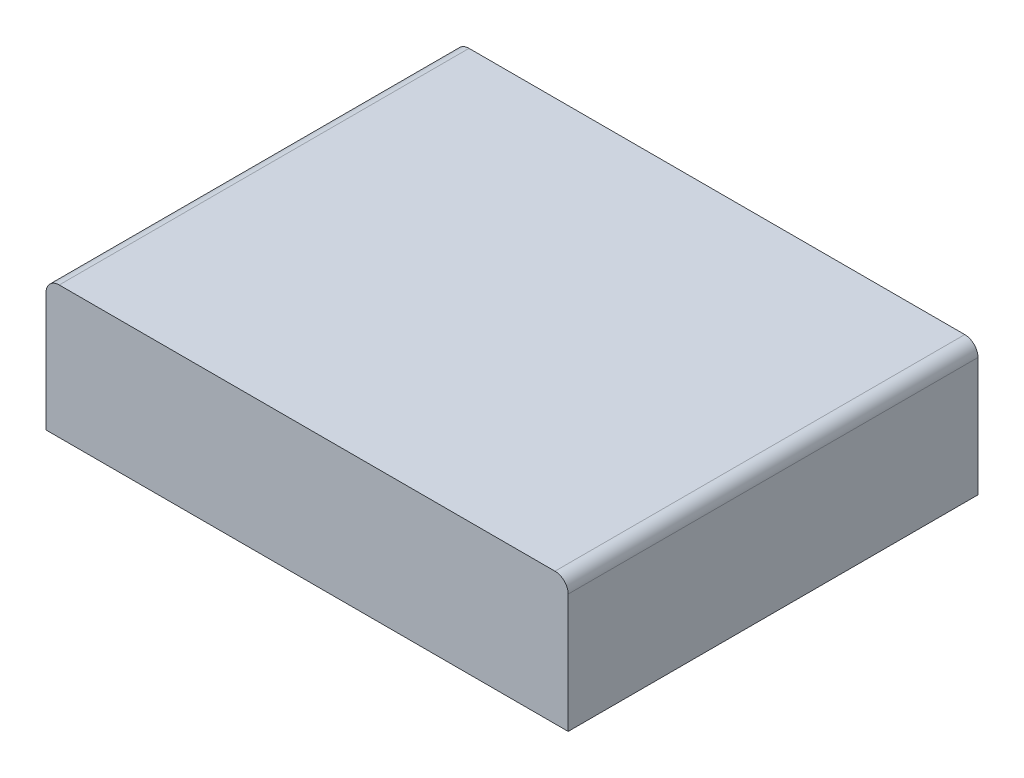
ISO-10303-21;
HEADER;
FILE_DESCRIPTION(('STEP AP214'),'2;1');
FILE_NAME('part.step','',(''),(''),'','','');
FILE_SCHEMA(('AUTOMOTIVE_DESIGN { 1 0 10303 214 1 1 1 1 }'));
ENDSEC;
DATA;
#1=APPLICATION_CONTEXT('core data for automotive mechanical design processes');
#2=APPLICATION_PROTOCOL_DEFINITION('international standard','automotive_design',2000,#1);
#3=PRODUCT_CONTEXT('',#1,'mechanical');
#4=PRODUCT('Part','Part','',(#3));
#5=PRODUCT_RELATED_PRODUCT_CATEGORY('part','',(#4));
#6=PRODUCT_DEFINITION_FORMATION('','',#4);
#7=PRODUCT_DEFINITION_CONTEXT('part definition',#1,'design');
#8=PRODUCT_DEFINITION('design','',#6,#7);
#9=PRODUCT_DEFINITION_SHAPE('','',#8);
#10=(LENGTH_UNIT() NAMED_UNIT(*) SI_UNIT(.MILLI.,.METRE.));
#11=(NAMED_UNIT(*) PLANE_ANGLE_UNIT() SI_UNIT($,.RADIAN.));
#12=(NAMED_UNIT(*) SI_UNIT($,.STERADIAN.) SOLID_ANGLE_UNIT());
#13=UNCERTAINTY_MEASURE_WITH_UNIT(LENGTH_MEASURE(1.E-05),#10,'distance_accuracy_value','');
#14=(GEOMETRIC_REPRESENTATION_CONTEXT(3) GLOBAL_UNCERTAINTY_ASSIGNED_CONTEXT((#13)) GLOBAL_UNIT_ASSIGNED_CONTEXT((#10,
#11,#12)) REPRESENTATION_CONTEXT('',''));
#15=CARTESIAN_POINT('',(0.,0.,0.));
#16=DIRECTION('',(0.,0.,1.));
#17=DIRECTION('',(1.,0.,0.));
#18=AXIS2_PLACEMENT_3D('',#15,#16,#17);
#19=CARTESIAN_POINT('',(11.6013862382831,39.1976983767566,241.577881707232));
#20=DIRECTION('',(0.,0.,1.));
#21=DIRECTION('',(1.,0.,0.));
#22=AXIS2_PLACEMENT_3D('',#19,#20,#21);
#23=CYLINDRICAL_SURFACE('',#22,0.0508);
#24=CARTESIAN_POINT('',(11.6013862382831,39.1976983767566,240.790481707232));
#25=DIRECTION('',(0.,0.,1.));
#26=DIRECTION('',(1.,0.,0.));
#27=AXIS2_PLACEMENT_3D('',#24,#25,#26);
#28=CIRCLE('',#27,0.0508);
#29=CARTESIAN_POINT('',(11.6013862382831,39.2484983767566,240.790481707232));
#30=VERTEX_POINT('',#29);
#31=CARTESIAN_POINT('',(11.5505862382831,39.1976983767566,240.790481707232));
#32=VERTEX_POINT('',#31);
#33=EDGE_CURVE('E126',#30,#32,#28,.T.);
#34=ORIENTED_EDGE('',*,*,#33,.T.);
#35=DIRECTION('',(0.,0.,-1.));
#36=VECTOR('',#35,1.);
#37=CARTESIAN_POINT('',(11.5505862382831,39.1976983767566,242.365281707232));
#38=LINE('',#37,#36);
#39=CARTESIAN_POINT('',(11.5505862382831,39.1976983767566,242.365281707232));
#40=VERTEX_POINT('',#39);
#41=EDGE_CURVE('E108',#32,#40,#38,.F.);
#42=ORIENTED_EDGE('',*,*,#41,.T.);
#43=CARTESIAN_POINT('',(11.6013862382831,39.1976983767566,242.365281707232));
#44=DIRECTION('',(0.,0.,1.));
#45=DIRECTION('',(1.,0.,0.));
#46=AXIS2_PLACEMENT_3D('',#43,#44,#45);
#47=CIRCLE('',#46,0.0508);
#48=CARTESIAN_POINT('',(11.6013862382831,39.2484983767566,242.365281707232));
#49=VERTEX_POINT('',#48);
#50=EDGE_CURVE('E19',#40,#49,#47,.F.);
#51=ORIENTED_EDGE('',*,*,#50,.T.);
#52=DIRECTION('',(0.,0.,-1.));
#53=VECTOR('',#52,1.);
#54=CARTESIAN_POINT('',(11.6013862382831,39.2484983767566,241.577881707232));
#55=LINE('',#54,#53);
#56=EDGE_CURVE('E104',#49,#30,#55,.T.);
#57=ORIENTED_EDGE('',*,*,#56,.T.);
#58=EDGE_LOOP('',(#34,#42,#51,#57));
#59=FACE_BOUND('',#58,.T.);
#60=ADVANCED_FACE('F16',(#59),#23,.T.);
#61=CARTESIAN_POINT('',(13.5063862382831,39.1976983767566,241.577881707232));
#62=DIRECTION('',(0.,0.,-1.));
#63=DIRECTION('',(-1.,0.,0.));
#64=AXIS2_PLACEMENT_3D('',#61,#62,#63);
#65=CYLINDRICAL_SURFACE('',#64,0.0508);
#66=CARTESIAN_POINT('',(13.5063862382831,39.1976983767566,242.365281707232));
#67=DIRECTION('',(0.,0.,-1.));
#68=DIRECTION('',(-1.,0.,0.));
#69=AXIS2_PLACEMENT_3D('',#66,#67,#68);
#70=CIRCLE('',#69,0.0508);
#71=CARTESIAN_POINT('',(13.5063862382831,39.2484983767566,242.365281707232));
#72=VERTEX_POINT('',#71);
#73=CARTESIAN_POINT('',(13.5571862382831,39.1976983767566,242.365281707232));
#74=VERTEX_POINT('',#73);
#75=EDGE_CURVE('E113',#72,#74,#70,.T.);
#76=ORIENTED_EDGE('',*,*,#75,.T.);
#77=DIRECTION('',(0.,0.,1.));
#78=VECTOR('',#77,1.);
#79=CARTESIAN_POINT('',(13.5571862382831,39.1976983767566,242.365281707232));
#80=LINE('',#79,#78);
#81=CARTESIAN_POINT('',(13.5571862382831,39.1976983767566,240.790481707232));
#82=VERTEX_POINT('',#81);
#83=EDGE_CURVE('E100',#74,#82,#80,.F.);
#84=ORIENTED_EDGE('',*,*,#83,.T.);
#85=CARTESIAN_POINT('',(13.5063862382831,39.1976983767566,240.790481707232));
#86=DIRECTION('',(0.,0.,-1.));
#87=DIRECTION('',(-1.,0.,0.));
#88=AXIS2_PLACEMENT_3D('',#85,#86,#87);
#89=CIRCLE('',#88,0.0508);
#90=CARTESIAN_POINT('',(13.5063862382831,39.2484983767566,240.790481707232));
#91=VERTEX_POINT('',#90);
#92=EDGE_CURVE('E122',#82,#91,#89,.F.);
#93=ORIENTED_EDGE('',*,*,#92,.T.);
#94=DIRECTION('',(0.,0.,-1.));
#95=VECTOR('',#94,1.);
#96=CARTESIAN_POINT('',(13.5063862382831,39.2484983767566,241.577881707232));
#97=LINE('',#96,#95);
#98=EDGE_CURVE('E109',#91,#72,#97,.F.);
#99=ORIENTED_EDGE('',*,*,#98,.T.);
#100=EDGE_LOOP('',(#76,#84,#93,#99));
#101=FACE_BOUND('',#100,.T.);
#102=ADVANCED_FACE('F160',(#101),#65,.T.);
#103=CARTESIAN_POINT('',(12.5538862382831,39.2484983767566,241.577881707232));
#104=DIRECTION('',(0.,-1.,0.));
#105=DIRECTION('',(0.,0.,-1.));
#106=AXIS2_PLACEMENT_3D('',#103,#104,#105);
#107=PLANE('',#106);
#108=DIRECTION('',(-1.,0.,0.));
#109=VECTOR('',#108,1.);
#110=CARTESIAN_POINT('',(11.5505862382831,39.2484983767566,242.365281707232));
#111=LINE('',#110,#109);
#112=EDGE_CURVE('E137',#49,#72,#111,.F.);
#113=ORIENTED_EDGE('',*,*,#112,.T.);
#114=ORIENTED_EDGE('',*,*,#98,.F.);
#115=DIRECTION('',(1.,0.,0.));
#116=VECTOR('',#115,1.);
#117=CARTESIAN_POINT('',(11.5505862382831,39.2484983767566,240.790481707232));
#118=LINE('',#117,#116);
#119=EDGE_CURVE('E117',#91,#30,#118,.F.);
#120=ORIENTED_EDGE('',*,*,#119,.T.);
#121=ORIENTED_EDGE('',*,*,#56,.F.);
#122=EDGE_LOOP('',(#113,#114,#120,#121));
#123=FACE_BOUND('',#122,.T.);
#124=ADVANCED_FACE('F135',(#123),#107,.F.);
#125=CARTESIAN_POINT('',(11.5505862382831,39.2484983767566,242.365281707232));
#126=DIRECTION('',(1.,0.,0.));
#127=DIRECTION('',(0.,0.,-1.));
#128=AXIS2_PLACEMENT_3D('',#125,#126,#127);
#129=PLANE('',#128);
#130=DIRECTION('',(0.,1.,0.));
#131=VECTOR('',#130,1.);
#132=CARTESIAN_POINT('',(11.5505862382831,39.2484983767566,240.790481707232));
#133=LINE('',#132,#131);
#134=CARTESIAN_POINT('',(11.5505862382831,38.7404983767566,240.790481707232));
#135=VERTEX_POINT('',#134);
#136=EDGE_CURVE('E78',#32,#135,#133,.F.);
#137=ORIENTED_EDGE('',*,*,#136,.T.);
#138=DIRECTION('',(0.,0.,-1.));
#139=VECTOR('',#138,1.);
#140=CARTESIAN_POINT('',(11.5505862382831,38.7404983767566,241.577881707232));
#141=LINE('',#140,#139);
#142=CARTESIAN_POINT('',(11.5505862382831,38.7404983767566,242.365281707232));
#143=VERTEX_POINT('',#142);
#144=EDGE_CURVE('E73',#143,#135,#141,.T.);
#145=ORIENTED_EDGE('',*,*,#144,.F.);
#146=DIRECTION('',(0.,1.,0.));
#147=VECTOR('',#146,1.);
#148=CARTESIAN_POINT('',(11.5505862382831,39.2484983767566,242.365281707232));
#149=LINE('',#148,#147);
#150=EDGE_CURVE('E76',#143,#40,#149,.T.);
#151=ORIENTED_EDGE('',*,*,#150,.T.);
#152=ORIENTED_EDGE('',*,*,#41,.F.);
#153=EDGE_LOOP('',(#137,#145,#151,#152));
#154=FACE_BOUND('',#153,.T.);
#155=ADVANCED_FACE('F74',(#154),#129,.F.);
#156=CARTESIAN_POINT('',(11.5505862382831,39.2484983767566,240.790481707232));
#157=DIRECTION('',(0.,0.,1.));
#158=DIRECTION('',(1.,0.,0.));
#159=AXIS2_PLACEMENT_3D('',#156,#157,#158);
#160=PLANE('',#159);
#161=ORIENTED_EDGE('',*,*,#119,.F.);
#162=ORIENTED_EDGE('',*,*,#92,.F.);
#163=DIRECTION('',(0.,1.,0.));
#164=VECTOR('',#163,1.);
#165=CARTESIAN_POINT('',(13.5571862382831,39.2484983767566,240.790481707232));
#166=LINE('',#165,#164);
#167=CARTESIAN_POINT('',(13.5571862382831,38.7404983767566,240.790481707232));
#168=VERTEX_POINT('',#167);
#169=EDGE_CURVE('E114',#82,#168,#166,.F.);
#170=ORIENTED_EDGE('',*,*,#169,.T.);
#171=DIRECTION('',(1.,0.,0.));
#172=VECTOR('',#171,1.);
#173=CARTESIAN_POINT('',(12.5538862382831,38.7404983767566,240.790481707232));
#174=LINE('',#173,#172);
#175=EDGE_CURVE('E83',#135,#168,#174,.T.);
#176=ORIENTED_EDGE('',*,*,#175,.F.);
#177=ORIENTED_EDGE('',*,*,#136,.F.);
#178=ORIENTED_EDGE('',*,*,#33,.F.);
#179=EDGE_LOOP('',(#161,#162,#170,#176,#177,#178));
#180=FACE_BOUND('',#179,.T.);
#181=ADVANCED_FACE('F163',(#180),#160,.F.);
#182=CARTESIAN_POINT('',(13.5571862382831,39.2484983767566,242.365281707232));
#183=DIRECTION('',(-1.,0.,0.));
#184=DIRECTION('',(0.,0.,1.));
#185=AXIS2_PLACEMENT_3D('',#182,#183,#184);
#186=PLANE('',#185);
#187=DIRECTION('',(0.,1.,0.));
#188=VECTOR('',#187,1.);
#189=CARTESIAN_POINT('',(13.5571862382831,39.2484983767566,242.365281707232));
#190=LINE('',#189,#188);
#191=CARTESIAN_POINT('',(13.5571862382831,38.7404983767566,242.365281707232));
#192=VERTEX_POINT('',#191);
#193=EDGE_CURVE('E35',#74,#192,#190,.F.);
#194=ORIENTED_EDGE('',*,*,#193,.T.);
#195=DIRECTION('',(0.,0.,-1.));
#196=VECTOR('',#195,1.);
#197=CARTESIAN_POINT('',(13.5571862382831,38.7404983767566,241.577881707232));
#198=LINE('',#197,#196);
#199=EDGE_CURVE('E26',#168,#192,#198,.F.);
#200=ORIENTED_EDGE('',*,*,#199,.F.);
#201=ORIENTED_EDGE('',*,*,#169,.F.);
#202=ORIENTED_EDGE('',*,*,#83,.F.);
#203=EDGE_LOOP('',(#194,#200,#201,#202));
#204=FACE_BOUND('',#203,.T.);
#205=ADVANCED_FACE('F161',(#204),#186,.F.);
#206=CARTESIAN_POINT('',(11.5505862382831,39.2484983767566,242.365281707232));
#207=DIRECTION('',(0.,0.,-1.));
#208=DIRECTION('',(-1.,0.,0.));
#209=AXIS2_PLACEMENT_3D('',#206,#207,#208);
#210=PLANE('',#209);
#211=ORIENTED_EDGE('',*,*,#150,.F.);
#212=DIRECTION('',(1.,0.,0.));
#213=VECTOR('',#212,1.);
#214=CARTESIAN_POINT('',(12.5538862382831,38.7404983767566,242.365281707232));
#215=LINE('',#214,#213);
#216=EDGE_CURVE('E10',#192,#143,#215,.F.);
#217=ORIENTED_EDGE('',*,*,#216,.F.);
#218=ORIENTED_EDGE('',*,*,#193,.F.);
#219=ORIENTED_EDGE('',*,*,#75,.F.);
#220=ORIENTED_EDGE('',*,*,#112,.F.);
#221=ORIENTED_EDGE('',*,*,#50,.F.);
#222=EDGE_LOOP('',(#211,#217,#218,#219,#220,#221));
#223=FACE_BOUND('',#222,.T.);
#224=ADVANCED_FACE('F85',(#223),#210,.F.);
#225=CARTESIAN_POINT('',(12.5538862382831,38.7404983767566,241.577881707232));
#226=DIRECTION('',(0.,-1.,0.));
#227=DIRECTION('',(0.,0.,-1.));
#228=AXIS2_PLACEMENT_3D('',#225,#226,#227);
#229=PLANE('',#228);
#230=ORIENTED_EDGE('',*,*,#199,.T.);
#231=ORIENTED_EDGE('',*,*,#216,.T.);
#232=ORIENTED_EDGE('',*,*,#144,.T.);
#233=ORIENTED_EDGE('',*,*,#175,.T.);
#234=EDGE_LOOP('',(#230,#231,#232,#233));
#235=FACE_BOUND('',#234,.T.);
#236=ADVANCED_FACE('F89',(#235),#229,.T.);
#237=CLOSED_SHELL('',(#60,#102,#124,#155,#181,#205,#224,#236));
#238=MANIFOLD_SOLID_BREP('B1',#237);
#239=ADVANCED_BREP_SHAPE_REPRESENTATION('',(#18,#238),#14);
#240=SHAPE_DEFINITION_REPRESENTATION(#9,#239);
ENDSEC;
END-ISO-10303-21;
